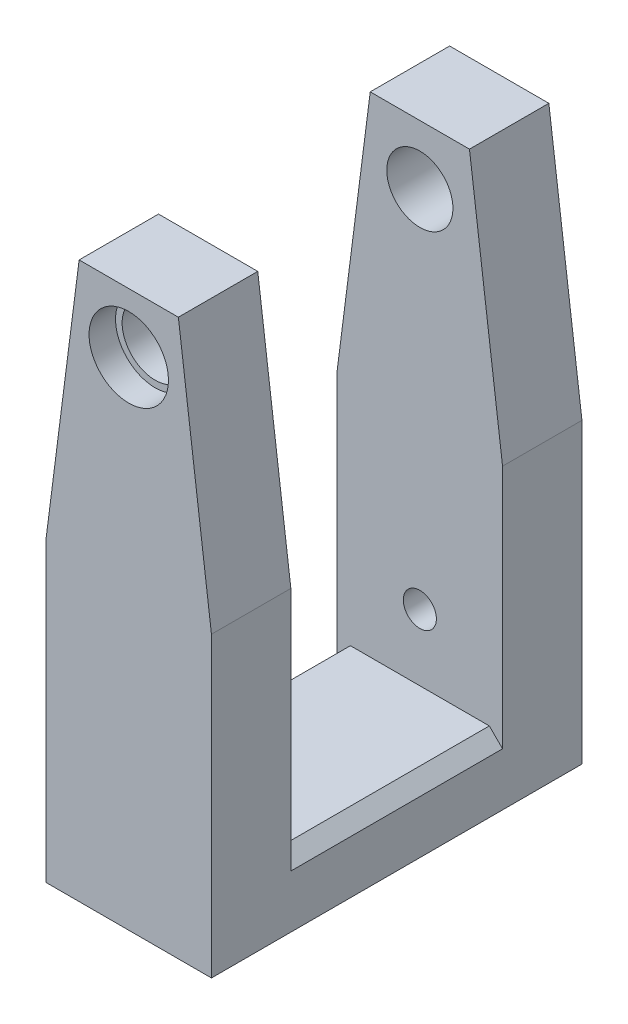
ISO-10303-21;
HEADER;
FILE_DESCRIPTION(('STEP AP214'),'2;1');
FILE_NAME('part.step','',(''),(''),'','','');
FILE_SCHEMA(('AUTOMOTIVE_DESIGN { 1 0 10303 214 1 1 1 1 }'));
ENDSEC;
DATA;
#1=APPLICATION_CONTEXT('core data for automotive mechanical design processes');
#2=APPLICATION_PROTOCOL_DEFINITION('international standard','automotive_design',2000,#1);
#3=PRODUCT_CONTEXT('',#1,'mechanical');
#4=PRODUCT('Part','Part','',(#3));
#5=PRODUCT_RELATED_PRODUCT_CATEGORY('part','',(#4));
#6=PRODUCT_DEFINITION_FORMATION('','',#4);
#7=PRODUCT_DEFINITION_CONTEXT('part definition',#1,'design');
#8=PRODUCT_DEFINITION('design','',#6,#7);
#9=PRODUCT_DEFINITION_SHAPE('','',#8);
#10=(LENGTH_UNIT() NAMED_UNIT(*) SI_UNIT(.MILLI.,.METRE.));
#11=(NAMED_UNIT(*) PLANE_ANGLE_UNIT() SI_UNIT($,.RADIAN.));
#12=(NAMED_UNIT(*) SI_UNIT($,.STERADIAN.) SOLID_ANGLE_UNIT());
#13=UNCERTAINTY_MEASURE_WITH_UNIT(LENGTH_MEASURE(1.E-05),#10,'distance_accuracy_value','');
#14=(GEOMETRIC_REPRESENTATION_CONTEXT(3) GLOBAL_UNCERTAINTY_ASSIGNED_CONTEXT((#13)) GLOBAL_UNIT_ASSIGNED_CONTEXT((#10,
#11,#12)) REPRESENTATION_CONTEXT('',''));
#15=CARTESIAN_POINT('',(0.,0.,0.));
#16=DIRECTION('',(0.,0.,1.));
#17=DIRECTION('',(1.,0.,0.));
#18=AXIS2_PLACEMENT_3D('',#15,#16,#17);
#19=CARTESIAN_POINT('',(7.5,84.,56.));
#20=DIRECTION('',(-0.991881664685851,-0.127164315985365,0.));
#21=DIRECTION('',(0.127164315985365,-0.991881664685851,0.));
#22=AXIS2_PLACEMENT_3D('',#19,#20,#21);
#23=PLANE('',#22);
#24=DIRECTION('',(0.,0.,-1.));
#25=VECTOR('',#24,1.);
#26=CARTESIAN_POINT('',(12.5,45.,56.));
#27=LINE('',#26,#25);
#28=CARTESIAN_POINT('',(12.5,45.,56.));
#29=VERTEX_POINT('',#28);
#30=CARTESIAN_POINT('',(12.5,45.,44.));
#31=VERTEX_POINT('',#30);
#32=EDGE_CURVE('E169',#29,#31,#27,.T.);
#33=ORIENTED_EDGE('',*,*,#32,.T.);
#34=DIRECTION('',(-0.127164315985365,0.991881664685851,0.));
#35=VECTOR('',#34,1.);
#36=CARTESIAN_POINT('',(7.5,84.,44.));
#37=LINE('',#36,#35);
#38=CARTESIAN_POINT('',(7.5,84.,44.));
#39=VERTEX_POINT('',#38);
#40=EDGE_CURVE('E239',#31,#39,#37,.T.);
#41=ORIENTED_EDGE('',*,*,#40,.T.);
#42=DIRECTION('',(0.,0.,-1.));
#43=VECTOR('',#42,1.);
#44=CARTESIAN_POINT('',(7.5,84.,56.));
#45=LINE('',#44,#43);
#46=CARTESIAN_POINT('',(7.5,84.,56.));
#47=VERTEX_POINT('',#46);
#48=EDGE_CURVE('E170',#47,#39,#45,.T.);
#49=ORIENTED_EDGE('',*,*,#48,.F.);
#50=DIRECTION('',(-0.127164315985365,0.991881664685851,0.));
#51=VECTOR('',#50,1.);
#52=CARTESIAN_POINT('',(7.5,84.,56.));
#53=LINE('',#52,#51);
#54=EDGE_CURVE('E248',#29,#47,#53,.T.);
#55=ORIENTED_EDGE('',*,*,#54,.F.);
#56=EDGE_LOOP('',(#33,#41,#49,#55));
#57=FACE_BOUND('',#56,.T.);
#58=ADVANCED_FACE('F45',(#57),#23,.F.);
#59=CARTESIAN_POINT('',(-7.5,84.,56.));
#60=DIRECTION('',(0.,-1.,0.));
#61=DIRECTION('',(0.,0.,-1.));
#62=AXIS2_PLACEMENT_3D('',#59,#60,#61);
#63=PLANE('',#62);
#64=ORIENTED_EDGE('',*,*,#48,.T.);
#65=DIRECTION('',(1.,0.,0.));
#66=VECTOR('',#65,1.);
#67=CARTESIAN_POINT('',(-43.5,84.,44.));
#68=LINE('',#67,#66);
#69=CARTESIAN_POINT('',(-7.5,84.,44.));
#70=VERTEX_POINT('',#69);
#71=EDGE_CURVE('E227',#70,#39,#68,.T.);
#72=ORIENTED_EDGE('',*,*,#71,.F.);
#73=DIRECTION('',(0.,0.,-1.));
#74=VECTOR('',#73,1.);
#75=CARTESIAN_POINT('',(-7.5,84.,56.));
#76=LINE('',#75,#74);
#77=CARTESIAN_POINT('',(-7.5,84.,56.));
#78=VERTEX_POINT('',#77);
#79=EDGE_CURVE('E275',#78,#70,#76,.T.);
#80=ORIENTED_EDGE('',*,*,#79,.F.);
#81=DIRECTION('',(-1.,0.,0.));
#82=VECTOR('',#81,1.);
#83=CARTESIAN_POINT('',(-7.5,84.,56.));
#84=LINE('',#83,#82);
#85=EDGE_CURVE('E250',#47,#78,#84,.T.);
#86=ORIENTED_EDGE('',*,*,#85,.F.);
#87=EDGE_LOOP('',(#64,#72,#80,#86));
#88=FACE_BOUND('',#87,.T.);
#89=ADVANCED_FACE('F308',(#88),#63,.F.);
#90=CARTESIAN_POINT('',(-12.5,45.,56.));
#91=DIRECTION('',(0.991881664685851,-0.127164315985365,0.));
#92=DIRECTION('',(0.127164315985365,0.991881664685851,0.));
#93=AXIS2_PLACEMENT_3D('',#90,#91,#92);
#94=PLANE('',#93);
#95=ORIENTED_EDGE('',*,*,#79,.T.);
#96=DIRECTION('',(-0.127164315985365,-0.991881664685851,0.));
#97=VECTOR('',#96,1.);
#98=CARTESIAN_POINT('',(-12.5,45.,44.));
#99=LINE('',#98,#97);
#100=CARTESIAN_POINT('',(-12.5,45.,44.));
#101=VERTEX_POINT('',#100);
#102=EDGE_CURVE('E161',#70,#101,#99,.T.);
#103=ORIENTED_EDGE('',*,*,#102,.T.);
#104=DIRECTION('',(0.,0.,-1.));
#105=VECTOR('',#104,1.);
#106=CARTESIAN_POINT('',(-12.5,45.,56.));
#107=LINE('',#106,#105);
#108=CARTESIAN_POINT('',(-12.5,45.,56.));
#109=VERTEX_POINT('',#108);
#110=EDGE_CURVE('E272',#109,#101,#107,.T.);
#111=ORIENTED_EDGE('',*,*,#110,.F.);
#112=DIRECTION('',(-0.127164315985365,-0.99188166468585,0.));
#113=VECTOR('',#112,1.);
#114=CARTESIAN_POINT('',(-12.5,45.,56.));
#115=LINE('',#114,#113);
#116=EDGE_CURVE('E252',#78,#109,#115,.T.);
#117=ORIENTED_EDGE('',*,*,#116,.F.);
#118=EDGE_LOOP('',(#95,#103,#111,#117));
#119=FACE_BOUND('',#118,.T.);
#120=ADVANCED_FACE('F304',(#119),#94,.F.);
#121=CARTESIAN_POINT('',(0.,0.,56.));
#122=DIRECTION('',(0.,1.,0.));
#123=DIRECTION('',(0.,0.,1.));
#124=AXIS2_PLACEMENT_3D('',#121,#122,#123);
#125=PLANE('',#124);
#126=DIRECTION('',(1.,0.,0.));
#127=VECTOR('',#126,1.);
#128=CARTESIAN_POINT('',(0.,0.,0.));
#129=LINE('',#128,#127);
#130=CARTESIAN_POINT('',(-12.5,0.,0.));
#131=VERTEX_POINT('',#130);
#132=CARTESIAN_POINT('',(12.5,0.,0.));
#133=VERTEX_POINT('',#132);
#134=EDGE_CURVE('E242',#131,#133,#129,.T.);
#135=ORIENTED_EDGE('',*,*,#134,.T.);
#136=DIRECTION('',(0.,0.,-1.));
#137=VECTOR('',#136,1.);
#138=CARTESIAN_POINT('',(12.5,0.,56.));
#139=LINE('',#138,#137);
#140=CARTESIAN_POINT('',(12.5,0.,56.));
#141=VERTEX_POINT('',#140);
#142=EDGE_CURVE('E173',#141,#133,#139,.T.);
#143=ORIENTED_EDGE('',*,*,#142,.F.);
#144=DIRECTION('',(1.,0.,0.));
#145=VECTOR('',#144,1.);
#146=CARTESIAN_POINT('',(-12.5,0.,56.));
#147=LINE('',#146,#145);
#148=CARTESIAN_POINT('',(-12.5,0.,56.));
#149=VERTEX_POINT('',#148);
#150=EDGE_CURVE('E243',#149,#141,#147,.T.);
#151=ORIENTED_EDGE('',*,*,#150,.F.);
#152=DIRECTION('',(0.,0.,-1.));
#153=VECTOR('',#152,1.);
#154=CARTESIAN_POINT('',(-12.5,0.,56.));
#155=LINE('',#154,#153);
#156=EDGE_CURVE('E256',#149,#131,#155,.T.);
#157=ORIENTED_EDGE('',*,*,#156,.T.);
#158=EDGE_LOOP('',(#135,#143,#151,#157));
#159=FACE_BOUND('',#158,.T.);
#160=ADVANCED_FACE('F297',(#159),#125,.F.);
#161=CARTESIAN_POINT('',(12.5,45.,56.));
#162=DIRECTION('',(-1.,0.,0.));
#163=DIRECTION('',(0.,-1.,0.));
#164=AXIS2_PLACEMENT_3D('',#161,#162,#163);
#165=PLANE('',#164);
#166=DIRECTION('',(0.,1.,0.));
#167=VECTOR('',#166,1.);
#168=CARTESIAN_POINT('',(12.5,84.,12.));
#169=LINE('',#168,#167);
#170=CARTESIAN_POINT('',(12.5,7.99999999999999,12.));
#171=VERTEX_POINT('',#170);
#172=CARTESIAN_POINT('',(12.5,45.,12.));
#173=VERTEX_POINT('',#172);
#174=EDGE_CURVE('E63',#171,#173,#169,.T.);
#175=ORIENTED_EDGE('',*,*,#174,.F.);
#176=DIRECTION('',(0.,0.,1.));
#177=VECTOR('',#176,1.);
#178=CARTESIAN_POINT('',(12.5,7.99999999999999,56.));
#179=LINE('',#178,#177);
#180=CARTESIAN_POINT('',(12.5,7.99999999999999,44.));
#181=VERTEX_POINT('',#180);
#182=EDGE_CURVE('E192',#171,#181,#179,.T.);
#183=ORIENTED_EDGE('',*,*,#182,.T.);
#184=DIRECTION('',(0.,-1.,0.));
#185=VECTOR('',#184,1.);
#186=CARTESIAN_POINT('',(12.5,84.,44.));
#187=LINE('',#186,#185);
#188=EDGE_CURVE('E70',#31,#181,#187,.T.);
#189=ORIENTED_EDGE('',*,*,#188,.F.);
#190=ORIENTED_EDGE('',*,*,#32,.F.);
#191=DIRECTION('',(0.,1.,0.));
#192=VECTOR('',#191,1.);
#193=CARTESIAN_POINT('',(12.5,45.,56.));
#194=LINE('',#193,#192);
#195=EDGE_CURVE('E245',#141,#29,#194,.T.);
#196=ORIENTED_EDGE('',*,*,#195,.F.);
#197=ORIENTED_EDGE('',*,*,#142,.T.);
#198=DIRECTION('',(0.,1.,0.));
#199=VECTOR('',#198,1.);
#200=CARTESIAN_POINT('',(12.5,45.,0.));
#201=LINE('',#200,#199);
#202=CARTESIAN_POINT('',(12.5,45.,0.));
#203=VERTEX_POINT('',#202);
#204=EDGE_CURVE('E167',#133,#203,#201,.T.);
#205=ORIENTED_EDGE('',*,*,#204,.T.);
#206=EDGE_CURVE('E158',#173,#203,#27,.T.);
#207=ORIENTED_EDGE('',*,*,#206,.F.);
#208=EDGE_LOOP('',(#175,#183,#189,#190,#196,#197,#205,#207));
#209=FACE_BOUND('',#208,.T.);
#210=ADVANCED_FACE('F164',(#209),#165,.F.);
#211=CARTESIAN_POINT('',(7.5,84.,12.));
#212=VERTEX_POINT('',#211);
#213=CARTESIAN_POINT('',(7.5,84.,0.));
#214=VERTEX_POINT('',#213);
#215=EDGE_CURVE('E160',#212,#214,#45,.T.);
#216=ORIENTED_EDGE('',*,*,#215,.F.);
#217=DIRECTION('',(0.127164315985365,-0.991881664685851,0.));
#218=VECTOR('',#217,1.);
#219=CARTESIAN_POINT('',(7.5,84.,12.));
#220=LINE('',#219,#218);
#221=EDGE_CURVE('E148',#212,#173,#220,.T.);
#222=ORIENTED_EDGE('',*,*,#221,.T.);
#223=ORIENTED_EDGE('',*,*,#206,.T.);
#224=DIRECTION('',(-0.127164315985365,0.991881664685851,0.));
#225=VECTOR('',#224,1.);
#226=CARTESIAN_POINT('',(7.5,84.,0.));
#227=LINE('',#226,#225);
#228=EDGE_CURVE('E259',#203,#214,#227,.T.);
#229=ORIENTED_EDGE('',*,*,#228,.T.);
#230=EDGE_LOOP('',(#216,#222,#223,#229));
#231=FACE_BOUND('',#230,.T.);
#232=ADVANCED_FACE('F156',(#231),#23,.F.);
#233=CARTESIAN_POINT('',(-7.5,84.,12.));
#234=VERTEX_POINT('',#233);
#235=CARTESIAN_POINT('',(-7.5,84.,0.));
#236=VERTEX_POINT('',#235);
#237=EDGE_CURVE('E274',#234,#236,#76,.T.);
#238=ORIENTED_EDGE('',*,*,#237,.F.);
#239=DIRECTION('',(1.,0.,0.));
#240=VECTOR('',#239,1.);
#241=CARTESIAN_POINT('',(-43.5,84.,12.));
#242=LINE('',#241,#240);
#243=EDGE_CURVE('E229',#234,#212,#242,.T.);
#244=ORIENTED_EDGE('',*,*,#243,.T.);
#245=ORIENTED_EDGE('',*,*,#215,.T.);
#246=DIRECTION('',(-1.,0.,0.));
#247=VECTOR('',#246,1.);
#248=CARTESIAN_POINT('',(-7.5,84.,0.));
#249=LINE('',#248,#247);
#250=EDGE_CURVE('E261',#214,#236,#249,.T.);
#251=ORIENTED_EDGE('',*,*,#250,.T.);
#252=EDGE_LOOP('',(#238,#244,#245,#251));
#253=FACE_BOUND('',#252,.T.);
#254=ADVANCED_FACE('F288',(#253),#63,.F.);
#255=CARTESIAN_POINT('',(-12.5,45.,12.));
#256=VERTEX_POINT('',#255);
#257=CARTESIAN_POINT('',(-12.5,45.,0.));
#258=VERTEX_POINT('',#257);
#259=EDGE_CURVE('E271',#256,#258,#107,.T.);
#260=ORIENTED_EDGE('',*,*,#259,.F.);
#261=DIRECTION('',(0.127164315985365,0.991881664685851,0.));
#262=VECTOR('',#261,1.);
#263=CARTESIAN_POINT('',(-12.5,45.,12.));
#264=LINE('',#263,#262);
#265=EDGE_CURVE('E162',#256,#234,#264,.T.);
#266=ORIENTED_EDGE('',*,*,#265,.T.);
#267=ORIENTED_EDGE('',*,*,#237,.T.);
#268=DIRECTION('',(-0.127164315985365,-0.99188166468585,0.));
#269=VECTOR('',#268,1.);
#270=CARTESIAN_POINT('',(-12.5,45.,0.));
#271=LINE('',#270,#269);
#272=EDGE_CURVE('E264',#236,#258,#271,.T.);
#273=ORIENTED_EDGE('',*,*,#272,.T.);
#274=EDGE_LOOP('',(#260,#266,#267,#273));
#275=FACE_BOUND('',#274,.T.);
#276=ADVANCED_FACE('F283',(#275),#94,.F.);
#277=CARTESIAN_POINT('',(-12.5,0.,56.));
#278=DIRECTION('',(1.,0.,0.));
#279=DIRECTION('',(0.,0.,-1.));
#280=AXIS2_PLACEMENT_3D('',#277,#278,#279);
#281=PLANE('',#280);
#282=DIRECTION('',(0.,0.,-1.));
#283=VECTOR('',#282,1.);
#284=CARTESIAN_POINT('',(-12.5,7.99999999999999,56.));
#285=LINE('',#284,#283);
#286=CARTESIAN_POINT('',(-12.5,7.99999999999999,44.));
#287=VERTEX_POINT('',#286);
#288=CARTESIAN_POINT('',(-12.5,7.99999999999999,12.));
#289=VERTEX_POINT('',#288);
#290=EDGE_CURVE('E184',#287,#289,#285,.T.);
#291=ORIENTED_EDGE('',*,*,#290,.T.);
#292=DIRECTION('',(0.,1.,0.));
#293=VECTOR('',#292,1.);
#294=CARTESIAN_POINT('',(-12.5,0.,12.));
#295=LINE('',#294,#293);
#296=EDGE_CURVE('E179',#289,#256,#295,.T.);
#297=ORIENTED_EDGE('',*,*,#296,.T.);
#298=ORIENTED_EDGE('',*,*,#259,.T.);
#299=DIRECTION('',(0.,-1.,0.));
#300=VECTOR('',#299,1.);
#301=CARTESIAN_POINT('',(-12.5,0.,0.));
#302=LINE('',#301,#300);
#303=EDGE_CURVE('E246',#258,#131,#302,.T.);
#304=ORIENTED_EDGE('',*,*,#303,.T.);
#305=ORIENTED_EDGE('',*,*,#156,.F.);
#306=DIRECTION('',(0.,-1.,0.));
#307=VECTOR('',#306,1.);
#308=CARTESIAN_POINT('',(-12.5,0.,56.));
#309=LINE('',#308,#307);
#310=EDGE_CURVE('E254',#109,#149,#309,.T.);
#311=ORIENTED_EDGE('',*,*,#310,.F.);
#312=ORIENTED_EDGE('',*,*,#110,.T.);
#313=DIRECTION('',(0.,-1.,0.));
#314=VECTOR('',#313,1.);
#315=CARTESIAN_POINT('',(-12.5,0.,44.));
#316=LINE('',#315,#314);
#317=EDGE_CURVE('E182',#101,#287,#316,.T.);
#318=ORIENTED_EDGE('',*,*,#317,.T.);
#319=EDGE_LOOP('',(#291,#297,#298,#304,#305,#311,#312,#318));
#320=FACE_BOUND('',#319,.T.);
#321=ADVANCED_FACE('F293',(#320),#281,.F.);
#322=CARTESIAN_POINT('',(0.,0.,56.));
#323=DIRECTION('',(0.,0.,-1.));
#324=DIRECTION('',(-1.,0.,0.));
#325=AXIS2_PLACEMENT_3D('',#322,#323,#324);
#326=PLANE('',#325);
#327=CARTESIAN_POINT('',(0.,75.,56.));
#328=DIRECTION('',(0.,0.,1.));
#329=DIRECTION('',(1.,0.,0.));
#330=AXIS2_PLACEMENT_3D('',#327,#328,#329);
#331=CIRCLE('',#330,6.);
#332=CARTESIAN_POINT('',(6.,75.,56.));
#333=VERTEX_POINT('',#332);
#334=EDGE_CURVE('E205',#333,#333,#331,.T.);
#335=ORIENTED_EDGE('',*,*,#334,.F.);
#336=EDGE_LOOP('',(#335));
#337=FACE_BOUND('',#336,.T.);
#338=ORIENTED_EDGE('',*,*,#150,.T.);
#339=ORIENTED_EDGE('',*,*,#195,.T.);
#340=ORIENTED_EDGE('',*,*,#54,.T.);
#341=ORIENTED_EDGE('',*,*,#85,.T.);
#342=ORIENTED_EDGE('',*,*,#116,.T.);
#343=ORIENTED_EDGE('',*,*,#310,.T.);
#344=EDGE_LOOP('',(#338,#339,#340,#341,#342,#343));
#345=FACE_BOUND('',#344,.T.);
#346=ADVANCED_FACE('F301',(#337,#345),#326,.F.);
#347=CARTESIAN_POINT('',(0.,0.,0.));
#348=DIRECTION('',(0.,0.,-1.));
#349=DIRECTION('',(-1.,0.,0.));
#350=AXIS2_PLACEMENT_3D('',#347,#348,#349);
#351=PLANE('',#350);
#352=CARTESIAN_POINT('',(0.,20.,0.));
#353=DIRECTION('',(0.,0.,-1.));
#354=DIRECTION('',(-1.,0.,0.));
#355=AXIS2_PLACEMENT_3D('',#352,#353,#354);
#356=CIRCLE('',#355,2.49999999999999);
#357=CARTESIAN_POINT('',(-2.49999999999999,20.,0.));
#358=VERTEX_POINT('',#357);
#359=EDGE_CURVE('E406',#358,#358,#356,.T.);
#360=ORIENTED_EDGE('',*,*,#359,.F.);
#361=EDGE_LOOP('',(#360));
#362=FACE_BOUND('',#361,.T.);
#363=CARTESIAN_POINT('',(0.,75.,0.));
#364=DIRECTION('',(0.,0.,-1.));
#365=DIRECTION('',(-1.,0.,0.));
#366=AXIS2_PLACEMENT_3D('',#363,#364,#365);
#367=CIRCLE('',#366,5.99999999999999);
#368=CARTESIAN_POINT('',(-5.99999999999999,75.,0.));
#369=VERTEX_POINT('',#368);
#370=EDGE_CURVE('E218',#369,#369,#367,.T.);
#371=ORIENTED_EDGE('',*,*,#370,.F.);
#372=EDGE_LOOP('',(#371));
#373=FACE_BOUND('',#372,.T.);
#374=ORIENTED_EDGE('',*,*,#134,.F.);
#375=ORIENTED_EDGE('',*,*,#303,.F.);
#376=ORIENTED_EDGE('',*,*,#272,.F.);
#377=ORIENTED_EDGE('',*,*,#250,.F.);
#378=ORIENTED_EDGE('',*,*,#228,.F.);
#379=ORIENTED_EDGE('',*,*,#204,.F.);
#380=EDGE_LOOP('',(#374,#375,#376,#377,#378,#379));
#381=FACE_BOUND('',#380,.T.);
#382=ADVANCED_FACE('F290',(#362,#373,#381),#351,.T.);
#383=CARTESIAN_POINT('',(-43.5,84.,44.));
#384=DIRECTION('',(0.,0.,1.));
#385=DIRECTION('',(0.,-1.,0.));
#386=AXIS2_PLACEMENT_3D('',#383,#384,#385);
#387=PLANE('',#386);
#388=CARTESIAN_POINT('',(0.,75.,44.));
#389=DIRECTION('',(0.,0.,1.));
#390=DIRECTION('',(0.,-1.,0.));
#391=AXIS2_PLACEMENT_3D('',#388,#389,#390);
#392=CIRCLE('',#391,5.);
#393=CARTESIAN_POINT('',(0.,70.,44.));
#394=VERTEX_POINT('',#393);
#395=EDGE_CURVE('E200',#394,#394,#392,.T.);
#396=ORIENTED_EDGE('',*,*,#395,.T.);
#397=EDGE_LOOP('',(#396));
#398=FACE_BOUND('',#397,.T.);
#399=ORIENTED_EDGE('',*,*,#188,.T.);
#400=DIRECTION('',(0.707106781186546,-0.707106781186549,0.));
#401=VECTOR('',#400,1.);
#402=CARTESIAN_POINT('',(-53.4999999999999,74.0000000000002,44.));
#403=LINE('',#402,#401);
#404=CARTESIAN_POINT('',(10.5,10.,44.));
#405=VERTEX_POINT('',#404);
#406=EDGE_CURVE('E11',#181,#405,#403,.F.);
#407=ORIENTED_EDGE('',*,*,#406,.T.);
#408=DIRECTION('',(1.,0.,0.));
#409=VECTOR('',#408,1.);
#410=CARTESIAN_POINT('',(-43.5,9.99999999999999,44.));
#411=LINE('',#410,#409);
#412=CARTESIAN_POINT('',(-10.5,10.,44.));
#413=VERTEX_POINT('',#412);
#414=EDGE_CURVE('E152',#413,#405,#411,.T.);
#415=ORIENTED_EDGE('',*,*,#414,.F.);
#416=DIRECTION('',(0.707106781186549,0.707106781186546,0.));
#417=VECTOR('',#416,1.);
#418=CARTESIAN_POINT('',(9.99999999999992,30.4999999999998,44.));
#419=LINE('',#418,#417);
#420=EDGE_CURVE('E196',#413,#287,#419,.F.);
#421=ORIENTED_EDGE('',*,*,#420,.T.);
#422=ORIENTED_EDGE('',*,*,#317,.F.);
#423=ORIENTED_EDGE('',*,*,#102,.F.);
#424=ORIENTED_EDGE('',*,*,#71,.T.);
#425=ORIENTED_EDGE('',*,*,#40,.F.);
#426=EDGE_LOOP('',(#399,#407,#415,#421,#422,#423,#424,#425));
#427=FACE_BOUND('',#426,.T.);
#428=ADVANCED_FACE('F306',(#398,#427),#387,.F.);
#429=CARTESIAN_POINT('',(-43.5,84.,12.));
#430=DIRECTION('',(0.,0.,-1.));
#431=DIRECTION('',(0.,1.,0.));
#432=AXIS2_PLACEMENT_3D('',#429,#430,#431);
#433=PLANE('',#432);
#434=CARTESIAN_POINT('',(0.,20.,12.));
#435=DIRECTION('',(0.,0.,-1.));
#436=DIRECTION('',(0.,1.,0.));
#437=AXIS2_PLACEMENT_3D('',#434,#435,#436);
#438=CIRCLE('',#437,2.49999999999999);
#439=CARTESIAN_POINT('',(0.,22.5,12.));
#440=VERTEX_POINT('',#439);
#441=EDGE_CURVE('E50',#440,#440,#438,.T.);
#442=ORIENTED_EDGE('',*,*,#441,.T.);
#443=EDGE_LOOP('',(#442));
#444=FACE_BOUND('',#443,.T.);
#445=CARTESIAN_POINT('',(0.,75.,12.));
#446=DIRECTION('',(0.,0.,-1.));
#447=DIRECTION('',(0.,1.,0.));
#448=AXIS2_PLACEMENT_3D('',#445,#446,#447);
#449=CIRCLE('',#448,4.99999999999999);
#450=CARTESIAN_POINT('',(0.,80.,12.));
#451=VERTEX_POINT('',#450);
#452=EDGE_CURVE('E203',#451,#451,#449,.T.);
#453=ORIENTED_EDGE('',*,*,#452,.T.);
#454=EDGE_LOOP('',(#453));
#455=FACE_BOUND('',#454,.T.);
#456=ORIENTED_EDGE('',*,*,#243,.F.);
#457=ORIENTED_EDGE('',*,*,#265,.F.);
#458=ORIENTED_EDGE('',*,*,#296,.F.);
#459=DIRECTION('',(-0.707106781186549,-0.707106781186546,0.));
#460=VECTOR('',#459,1.);
#461=CARTESIAN_POINT('',(9.99999999999992,30.4999999999998,12.));
#462=LINE('',#461,#460);
#463=CARTESIAN_POINT('',(-10.5,10.,12.));
#464=VERTEX_POINT('',#463);
#465=EDGE_CURVE('E194',#289,#464,#462,.F.);
#466=ORIENTED_EDGE('',*,*,#465,.T.);
#467=DIRECTION('',(1.,0.,0.));
#468=VECTOR('',#467,1.);
#469=CARTESIAN_POINT('',(-43.5,9.99999999999999,12.));
#470=LINE('',#469,#468);
#471=CARTESIAN_POINT('',(10.5,10.,12.));
#472=VERTEX_POINT('',#471);
#473=EDGE_CURVE('E231',#464,#472,#470,.T.);
#474=ORIENTED_EDGE('',*,*,#473,.T.);
#475=DIRECTION('',(-0.707106781186546,0.707106781186549,0.));
#476=VECTOR('',#475,1.);
#477=CARTESIAN_POINT('',(-53.4999999999999,74.0000000000002,12.));
#478=LINE('',#477,#476);
#479=EDGE_CURVE('E55',#472,#171,#478,.F.);
#480=ORIENTED_EDGE('',*,*,#479,.T.);
#481=ORIENTED_EDGE('',*,*,#174,.T.);
#482=ORIENTED_EDGE('',*,*,#221,.F.);
#483=EDGE_LOOP('',(#456,#457,#458,#466,#474,#480,#481,#482));
#484=FACE_BOUND('',#483,.T.);
#485=ADVANCED_FACE('F147',(#444,#455,#484),#433,.F.);
#486=CARTESIAN_POINT('',(-43.5,9.99999999999999,44.));
#487=DIRECTION('',(0.,-1.,0.));
#488=DIRECTION('',(1.,0.,0.));
#489=AXIS2_PLACEMENT_3D('',#486,#487,#488);
#490=PLANE('',#489);
#491=ORIENTED_EDGE('',*,*,#473,.F.);
#492=DIRECTION('',(0.,0.,1.));
#493=VECTOR('',#492,1.);
#494=CARTESIAN_POINT('',(-10.5,10.,44.));
#495=LINE('',#494,#493);
#496=EDGE_CURVE('E190',#464,#413,#495,.T.);
#497=ORIENTED_EDGE('',*,*,#496,.T.);
#498=ORIENTED_EDGE('',*,*,#414,.T.);
#499=DIRECTION('',(0.,0.,-1.));
#500=VECTOR('',#499,1.);
#501=CARTESIAN_POINT('',(10.5,10.,44.));
#502=LINE('',#501,#500);
#503=EDGE_CURVE('E187',#405,#472,#502,.T.);
#504=ORIENTED_EDGE('',*,*,#503,.T.);
#505=EDGE_LOOP('',(#491,#497,#498,#504));
#506=FACE_BOUND('',#505,.T.);
#507=ADVANCED_FACE('F320',(#506),#490,.F.);
#508=CARTESIAN_POINT('',(-12.5,7.99999999999999,56.));
#509=DIRECTION('',(0.707106781186546,-0.707106781186549,0.));
#510=DIRECTION('',(0.,0.,-1.));
#511=AXIS2_PLACEMENT_3D('',#508,#509,#510);
#512=PLANE('',#511);
#513=ORIENTED_EDGE('',*,*,#420,.F.);
#514=ORIENTED_EDGE('',*,*,#496,.F.);
#515=ORIENTED_EDGE('',*,*,#465,.F.);
#516=ORIENTED_EDGE('',*,*,#290,.F.);
#517=EDGE_LOOP('',(#513,#514,#515,#516));
#518=FACE_BOUND('',#517,.T.);
#519=ADVANCED_FACE('F324',(#518),#512,.F.);
#520=CARTESIAN_POINT('',(10.5,10.,44.));
#521=DIRECTION('',(-0.707106781186549,-0.707106781186546,0.));
#522=DIRECTION('',(0.,0.,-1.));
#523=AXIS2_PLACEMENT_3D('',#520,#521,#522);
#524=PLANE('',#523);
#525=ORIENTED_EDGE('',*,*,#406,.F.);
#526=ORIENTED_EDGE('',*,*,#182,.F.);
#527=ORIENTED_EDGE('',*,*,#479,.F.);
#528=ORIENTED_EDGE('',*,*,#503,.F.);
#529=EDGE_LOOP('',(#525,#526,#527,#528));
#530=FACE_BOUND('',#529,.T.);
#531=ADVANCED_FACE('F48',(#530),#524,.F.);
#532=CARTESIAN_POINT('',(0.,75.,56.));
#533=DIRECTION('',(0.,0.,1.));
#534=DIRECTION('',(1.,0.,0.));
#535=AXIS2_PLACEMENT_3D('',#532,#533,#534);
#536=CYLINDRICAL_SURFACE('',#535,5.);
#537=CARTESIAN_POINT('',(0.,75.,52.));
#538=DIRECTION('',(0.,0.,1.));
#539=DIRECTION('',(1.,0.,0.));
#540=AXIS2_PLACEMENT_3D('',#537,#538,#539);
#541=CIRCLE('',#540,5.);
#542=CARTESIAN_POINT('',(5.,75.,52.));
#543=VERTEX_POINT('',#542);
#544=EDGE_CURVE('E202',#543,#543,#541,.T.);
#545=ORIENTED_EDGE('',*,*,#544,.T.);
#546=EDGE_LOOP('',(#545));
#547=FACE_BOUND('',#546,.T.);
#548=ORIENTED_EDGE('',*,*,#395,.F.);
#549=EDGE_LOOP('',(#548));
#550=FACE_BOUND('',#549,.T.);
#551=ADVANCED_FACE('F331',(#547,#550),#536,.F.);
#552=CARTESIAN_POINT('',(5.,75.,52.));
#553=DIRECTION('',(0.,0.,-1.));
#554=DIRECTION('',(-1.,0.,0.));
#555=AXIS2_PLACEMENT_3D('',#552,#553,#554);
#556=PLANE('',#555);
#557=ORIENTED_EDGE('',*,*,#544,.F.);
#558=EDGE_LOOP('',(#557));
#559=FACE_BOUND('',#558,.T.);
#560=CARTESIAN_POINT('',(0.,75.,52.));
#561=DIRECTION('',(0.,0.,1.));
#562=DIRECTION('',(1.,0.,0.));
#563=AXIS2_PLACEMENT_3D('',#560,#561,#562);
#564=CIRCLE('',#563,6.);
#565=CARTESIAN_POINT('',(6.,75.,52.));
#566=VERTEX_POINT('',#565);
#567=EDGE_CURVE('E210',#566,#566,#564,.T.);
#568=ORIENTED_EDGE('',*,*,#567,.T.);
#569=EDGE_LOOP('',(#568));
#570=FACE_BOUND('',#569,.T.);
#571=ADVANCED_FACE('F378',(#559,#570),#556,.F.);
#572=CARTESIAN_POINT('',(0.,75.,56.));
#573=DIRECTION('',(0.,0.,1.));
#574=DIRECTION('',(1.,0.,0.));
#575=AXIS2_PLACEMENT_3D('',#572,#573,#574);
#576=CYLINDRICAL_SURFACE('',#575,6.);
#577=ORIENTED_EDGE('',*,*,#567,.F.);
#578=EDGE_LOOP('',(#577));
#579=FACE_BOUND('',#578,.T.);
#580=ORIENTED_EDGE('',*,*,#334,.T.);
#581=EDGE_LOOP('',(#580));
#582=FACE_BOUND('',#581,.T.);
#583=ADVANCED_FACE('F382',(#579,#582),#576,.F.);
#584=CARTESIAN_POINT('',(0.,75.,0.));
#585=DIRECTION('',(0.,0.,-1.));
#586=DIRECTION('',(-1.,0.,0.));
#587=AXIS2_PLACEMENT_3D('',#584,#585,#586);
#588=CYLINDRICAL_SURFACE('',#587,4.99999999999999);
#589=CARTESIAN_POINT('',(0.,75.,4.));
#590=DIRECTION('',(0.,0.,-1.));
#591=DIRECTION('',(-1.,0.,0.));
#592=AXIS2_PLACEMENT_3D('',#589,#590,#591);
#593=CIRCLE('',#592,5.);
#594=CARTESIAN_POINT('',(-5.,75.,4.));
#595=VERTEX_POINT('',#594);
#596=EDGE_CURVE('E206',#595,#595,#593,.T.);
#597=ORIENTED_EDGE('',*,*,#596,.T.);
#598=EDGE_LOOP('',(#597));
#599=FACE_BOUND('',#598,.T.);
#600=ORIENTED_EDGE('',*,*,#452,.F.);
#601=EDGE_LOOP('',(#600));
#602=FACE_BOUND('',#601,.T.);
#603=ADVANCED_FACE('F386',(#599,#602),#588,.F.);
#604=CARTESIAN_POINT('',(5.,75.,4.));
#605=DIRECTION('',(0.,0.,1.));
#606=DIRECTION('',(1.,0.,0.));
#607=AXIS2_PLACEMENT_3D('',#604,#605,#606);
#608=PLANE('',#607);
#609=ORIENTED_EDGE('',*,*,#596,.F.);
#610=EDGE_LOOP('',(#609));
#611=FACE_BOUND('',#610,.T.);
#612=CARTESIAN_POINT('',(0.,75.,4.));
#613=DIRECTION('',(0.,0.,-1.));
#614=DIRECTION('',(-1.,0.,0.));
#615=AXIS2_PLACEMENT_3D('',#612,#613,#614);
#616=CIRCLE('',#615,5.99999999999999);
#617=CARTESIAN_POINT('',(-5.99999999999999,75.,4.));
#618=VERTEX_POINT('',#617);
#619=EDGE_CURVE('E213',#618,#618,#616,.T.);
#620=ORIENTED_EDGE('',*,*,#619,.T.);
#621=EDGE_LOOP('',(#620));
#622=FACE_BOUND('',#621,.T.);
#623=ADVANCED_FACE('F390',(#611,#622),#608,.F.);
#624=CARTESIAN_POINT('',(0.,75.,0.));
#625=DIRECTION('',(0.,0.,-1.));
#626=DIRECTION('',(-1.,0.,0.));
#627=AXIS2_PLACEMENT_3D('',#624,#625,#626);
#628=CYLINDRICAL_SURFACE('',#627,5.99999999999999);
#629=ORIENTED_EDGE('',*,*,#619,.F.);
#630=EDGE_LOOP('',(#629));
#631=FACE_BOUND('',#630,.T.);
#632=ORIENTED_EDGE('',*,*,#370,.T.);
#633=EDGE_LOOP('',(#632));
#634=FACE_BOUND('',#633,.T.);
#635=ADVANCED_FACE('F393',(#631,#634),#628,.F.);
#636=CARTESIAN_POINT('',(0.,20.,0.));
#637=DIRECTION('',(0.,0.,-1.));
#638=DIRECTION('',(-1.,0.,0.));
#639=AXIS2_PLACEMENT_3D('',#636,#637,#638);
#640=CYLINDRICAL_SURFACE('',#639,2.49999999999999);
#641=ORIENTED_EDGE('',*,*,#359,.T.);
#642=EDGE_LOOP('',(#641));
#643=FACE_BOUND('',#642,.T.);
#644=ORIENTED_EDGE('',*,*,#441,.F.);
#645=EDGE_LOOP('',(#644));
#646=FACE_BOUND('',#645,.T.);
#647=ADVANCED_FACE('F397',(#643,#646),#640,.F.);
#648=CLOSED_SHELL('',(#58,#89,#120,#160,#210,#232,#254,#276,#321,#346,#382,#428,#485,#507,#519,
#531,#551,#571,#583,#603,#623,#635,#647));
#649=MANIFOLD_SOLID_BREP('B2',#648);
#650=ADVANCED_BREP_SHAPE_REPRESENTATION('',(#18,#649),#14);
#651=SHAPE_DEFINITION_REPRESENTATION(#9,#650);
ENDSEC;
END-ISO-10303-21;
